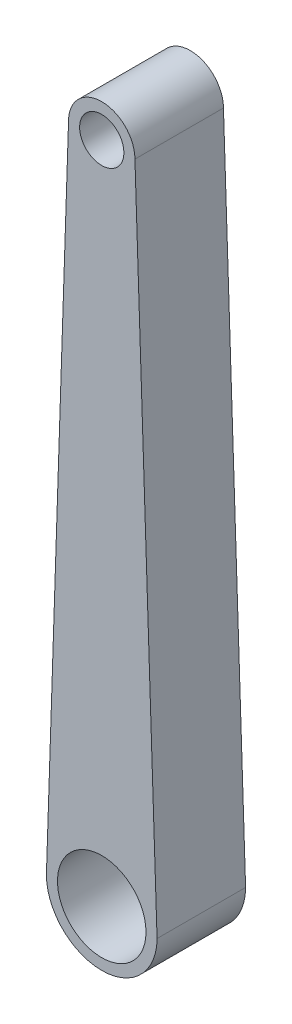
ISO-10303-21;
HEADER;
FILE_DESCRIPTION(('STEP AP214'),'2;1');
FILE_NAME('part.step','',(''),(''),'','','');
FILE_SCHEMA(('AUTOMOTIVE_DESIGN { 1 0 10303 214 1 1 1 1 }'));
ENDSEC;
DATA;
#1=APPLICATION_CONTEXT('core data for automotive mechanical design processes');
#2=APPLICATION_PROTOCOL_DEFINITION('international standard','automotive_design',2000,#1);
#3=PRODUCT_CONTEXT('',#1,'mechanical');
#4=PRODUCT('Part','Part','',(#3));
#5=PRODUCT_RELATED_PRODUCT_CATEGORY('part','',(#4));
#6=PRODUCT_DEFINITION_FORMATION('','',#4);
#7=PRODUCT_DEFINITION_CONTEXT('part definition',#1,'design');
#8=PRODUCT_DEFINITION('design','',#6,#7);
#9=PRODUCT_DEFINITION_SHAPE('','',#8);
#10=(LENGTH_UNIT() NAMED_UNIT(*) SI_UNIT(.MILLI.,.METRE.));
#11=(NAMED_UNIT(*) PLANE_ANGLE_UNIT() SI_UNIT($,.RADIAN.));
#12=(NAMED_UNIT(*) SI_UNIT($,.STERADIAN.) SOLID_ANGLE_UNIT());
#13=UNCERTAINTY_MEASURE_WITH_UNIT(LENGTH_MEASURE(1.E-05),#10,'distance_accuracy_value','');
#14=(GEOMETRIC_REPRESENTATION_CONTEXT(3) GLOBAL_UNCERTAINTY_ASSIGNED_CONTEXT((#13)) GLOBAL_UNIT_ASSIGNED_CONTEXT((#10,
#11,#12)) REPRESENTATION_CONTEXT('',''));
#15=CARTESIAN_POINT('',(0.,0.,0.));
#16=DIRECTION('',(0.,0.,1.));
#17=DIRECTION('',(1.,0.,0.));
#18=AXIS2_PLACEMENT_3D('',#15,#16,#17);
#19=CARTESIAN_POINT('',(-23.1485297273929,0.771617657579759,40.));
#20=DIRECTION('',(0.999444906979154,-0.0333148302326384,0.));
#21=DIRECTION('',(0.0333148302326384,0.999444906979154,0.));
#22=AXIS2_PLACEMENT_3D('',#19,#20,#21);
#23=PLANE('',#22);
#24=DIRECTION('',(-0.0333148302326384,-0.999444906979154,0.));
#25=VECTOR('',#24,1.);
#26=CARTESIAN_POINT('',(-23.1485297273929,0.771617657579759,0.));
#27=LINE('',#26,#25);
#28=CARTESIAN_POINT('',(-15.,245.227509479367,0.));
#29=VERTEX_POINT('',#28);
#30=CARTESIAN_POINT('',(-25.,-54.7724905206331,0.));
#31=VERTEX_POINT('',#30);
#32=EDGE_CURVE('E105',#29,#31,#27,.T.);
#33=ORIENTED_EDGE('',*,*,#32,.T.);
#34=DIRECTION('',(0.,0.,-1.));
#35=VECTOR('',#34,1.);
#36=CARTESIAN_POINT('',(-25.,-54.7724905206331,40.));
#37=LINE('',#36,#35);
#38=CARTESIAN_POINT('',(-25.,-54.7724905206331,40.));
#39=VERTEX_POINT('',#38);
#40=EDGE_CURVE('E11',#39,#31,#37,.T.);
#41=ORIENTED_EDGE('',*,*,#40,.F.);
#42=DIRECTION('',(-0.0333148302326384,-0.999444906979154,0.));
#43=VECTOR('',#42,1.);
#44=CARTESIAN_POINT('',(-23.1485297273929,0.771617657579759,40.));
#45=LINE('',#44,#43);
#46=CARTESIAN_POINT('',(-15.,245.227509479367,40.));
#47=VERTEX_POINT('',#46);
#48=EDGE_CURVE('E84',#47,#39,#45,.T.);
#49=ORIENTED_EDGE('',*,*,#48,.F.);
#50=DIRECTION('',(0.,0.,-1.));
#51=VECTOR('',#50,1.);
#52=CARTESIAN_POINT('',(-15.,245.227509479367,40.));
#53=LINE('',#52,#51);
#54=EDGE_CURVE('E95',#47,#29,#53,.T.);
#55=ORIENTED_EDGE('',*,*,#54,.T.);
#56=EDGE_LOOP('',(#33,#41,#49,#55));
#57=FACE_BOUND('',#56,.T.);
#58=ADVANCED_FACE('F36',(#57),#23,.F.);
#59=CARTESIAN_POINT('',(0.,-54.7724905206331,40.));
#60=DIRECTION('',(0.,0.,-1.));
#61=DIRECTION('',(-1.,0.,0.));
#62=AXIS2_PLACEMENT_3D('',#59,#60,#61);
#63=CYLINDRICAL_SURFACE('',#62,25.);
#64=CARTESIAN_POINT('',(0.,-54.7724905206331,0.));
#65=DIRECTION('',(0.,0.,1.));
#66=DIRECTION('',(1.,0.,0.));
#67=AXIS2_PLACEMENT_3D('',#64,#65,#66);
#68=CIRCLE('',#67,25.);
#69=CARTESIAN_POINT('',(25.,-54.7724905206331,0.));
#70=VERTEX_POINT('',#69);
#71=EDGE_CURVE('E89',#31,#70,#68,.T.);
#72=ORIENTED_EDGE('',*,*,#71,.T.);
#73=DIRECTION('',(0.,0.,-1.));
#74=VECTOR('',#73,1.);
#75=CARTESIAN_POINT('',(25.,-54.7724905206331,40.));
#76=LINE('',#75,#74);
#77=CARTESIAN_POINT('',(25.,-54.7724905206331,40.));
#78=VERTEX_POINT('',#77);
#79=EDGE_CURVE('E45',#78,#70,#76,.T.);
#80=ORIENTED_EDGE('',*,*,#79,.F.);
#81=CARTESIAN_POINT('',(0.,-54.7724905206331,40.));
#82=DIRECTION('',(0.,0.,1.));
#83=DIRECTION('',(1.,0.,0.));
#84=AXIS2_PLACEMENT_3D('',#81,#82,#83);
#85=CIRCLE('',#84,25.);
#86=EDGE_CURVE('E79',#39,#78,#85,.T.);
#87=ORIENTED_EDGE('',*,*,#86,.F.);
#88=ORIENTED_EDGE('',*,*,#40,.T.);
#89=EDGE_LOOP('',(#72,#80,#87,#88));
#90=FACE_BOUND('',#89,.T.);
#91=ADVANCED_FACE('F88',(#90),#63,.T.);
#92=CARTESIAN_POINT('',(23.1485297273929,0.771617657579759,40.));
#93=DIRECTION('',(0.999444906979154,0.0333148302326384,0.));
#94=DIRECTION('',(-0.0333148302326384,0.999444906979154,0.));
#95=AXIS2_PLACEMENT_3D('',#92,#93,#94);
#96=PLANE('',#95);
#97=DIRECTION('',(0.0333148302326384,-0.999444906979154,0.));
#98=VECTOR('',#97,1.);
#99=CARTESIAN_POINT('',(23.1485297273929,0.771617657579759,0.));
#100=LINE('',#99,#98);
#101=CARTESIAN_POINT('',(15.,245.227509479367,0.));
#102=VERTEX_POINT('',#101);
#103=EDGE_CURVE('E109',#102,#70,#100,.T.);
#104=ORIENTED_EDGE('',*,*,#103,.F.);
#105=DIRECTION('',(0.,0.,-1.));
#106=VECTOR('',#105,1.);
#107=CARTESIAN_POINT('',(15.,245.227509479367,40.));
#108=LINE('',#107,#106);
#109=CARTESIAN_POINT('',(15.,245.227509479367,40.));
#110=VERTEX_POINT('',#109);
#111=EDGE_CURVE('E69',#110,#102,#108,.T.);
#112=ORIENTED_EDGE('',*,*,#111,.F.);
#113=DIRECTION('',(0.0333148302326384,-0.999444906979154,0.));
#114=VECTOR('',#113,1.);
#115=CARTESIAN_POINT('',(23.1485297273929,0.771617657579759,40.));
#116=LINE('',#115,#114);
#117=EDGE_CURVE('E82',#110,#78,#116,.T.);
#118=ORIENTED_EDGE('',*,*,#117,.T.);
#119=ORIENTED_EDGE('',*,*,#79,.T.);
#120=EDGE_LOOP('',(#104,#112,#118,#119));
#121=FACE_BOUND('',#120,.T.);
#122=ADVANCED_FACE('F93',(#121),#96,.T.);
#123=CARTESIAN_POINT('',(0.,245.227509479367,40.));
#124=DIRECTION('',(0.,0.,-1.));
#125=DIRECTION('',(-1.,0.,0.));
#126=AXIS2_PLACEMENT_3D('',#123,#124,#125);
#127=CYLINDRICAL_SURFACE('',#126,10.);
#128=CARTESIAN_POINT('',(0.,245.227509479367,40.));
#129=DIRECTION('',(0.,0.,1.));
#130=DIRECTION('',(1.,0.,0.));
#131=AXIS2_PLACEMENT_3D('',#128,#129,#130);
#132=CIRCLE('',#131,10.);
#133=CARTESIAN_POINT('',(10.,245.227509479367,40.));
#134=VERTEX_POINT('',#133);
#135=EDGE_CURVE('E147',#134,#134,#132,.T.);
#136=ORIENTED_EDGE('',*,*,#135,.T.);
#137=EDGE_LOOP('',(#136));
#138=FACE_BOUND('',#137,.T.);
#139=CARTESIAN_POINT('',(0.,245.227509479367,0.));
#140=DIRECTION('',(0.,0.,1.));
#141=DIRECTION('',(1.,0.,0.));
#142=AXIS2_PLACEMENT_3D('',#139,#140,#141);
#143=CIRCLE('',#142,10.);
#144=CARTESIAN_POINT('',(10.,245.227509479367,0.));
#145=VERTEX_POINT('',#144);
#146=EDGE_CURVE('E102',#145,#145,#143,.T.);
#147=ORIENTED_EDGE('',*,*,#146,.F.);
#148=EDGE_LOOP('',(#147));
#149=FACE_BOUND('',#148,.T.);
#150=ADVANCED_FACE('F136',(#138,#149),#127,.F.);
#151=CARTESIAN_POINT('',(0.,-54.7724905206331,40.));
#152=DIRECTION('',(0.,0.,-1.));
#153=DIRECTION('',(-1.,0.,0.));
#154=AXIS2_PLACEMENT_3D('',#151,#152,#153);
#155=CYLINDRICAL_SURFACE('',#154,20.);
#156=CARTESIAN_POINT('',(0.,-54.7724905206331,40.));
#157=DIRECTION('',(0.,0.,1.));
#158=DIRECTION('',(1.,0.,0.));
#159=AXIS2_PLACEMENT_3D('',#156,#157,#158);
#160=CIRCLE('',#159,20.);
#161=CARTESIAN_POINT('',(20.,-54.7724905206331,40.));
#162=VERTEX_POINT('',#161);
#163=EDGE_CURVE('E112',#162,#162,#160,.T.);
#164=ORIENTED_EDGE('',*,*,#163,.T.);
#165=EDGE_LOOP('',(#164));
#166=FACE_BOUND('',#165,.T.);
#167=CARTESIAN_POINT('',(0.,-54.7724905206331,0.));
#168=DIRECTION('',(0.,0.,1.));
#169=DIRECTION('',(1.,0.,0.));
#170=AXIS2_PLACEMENT_3D('',#167,#168,#169);
#171=CIRCLE('',#170,20.);
#172=CARTESIAN_POINT('',(20.,-54.7724905206331,0.));
#173=VERTEX_POINT('',#172);
#174=EDGE_CURVE('E99',#173,#173,#171,.T.);
#175=ORIENTED_EDGE('',*,*,#174,.F.);
#176=EDGE_LOOP('',(#175));
#177=FACE_BOUND('',#176,.T.);
#178=ADVANCED_FACE('F38',(#166,#177),#155,.F.);
#179=CARTESIAN_POINT('',(0.,245.227509479367,40.));
#180=DIRECTION('',(0.,0.,-1.));
#181=DIRECTION('',(-1.,0.,0.));
#182=AXIS2_PLACEMENT_3D('',#179,#180,#181);
#183=CYLINDRICAL_SURFACE('',#182,15.);
#184=CARTESIAN_POINT('',(0.,245.227509479367,0.));
#185=DIRECTION('',(0.,0.,1.));
#186=DIRECTION('',(1.,0.,0.));
#187=AXIS2_PLACEMENT_3D('',#184,#185,#186);
#188=CIRCLE('',#187,15.);
#189=EDGE_CURVE('E72',#102,#29,#188,.T.);
#190=ORIENTED_EDGE('',*,*,#189,.T.);
#191=ORIENTED_EDGE('',*,*,#54,.F.);
#192=CARTESIAN_POINT('',(0.,245.227509479367,40.));
#193=DIRECTION('',(0.,0.,1.));
#194=DIRECTION('',(1.,0.,0.));
#195=AXIS2_PLACEMENT_3D('',#192,#193,#194);
#196=CIRCLE('',#195,15.);
#197=EDGE_CURVE('E53',#110,#47,#196,.T.);
#198=ORIENTED_EDGE('',*,*,#197,.F.);
#199=ORIENTED_EDGE('',*,*,#111,.T.);
#200=EDGE_LOOP('',(#190,#191,#198,#199));
#201=FACE_BOUND('',#200,.T.);
#202=ADVANCED_FACE('F124',(#201),#183,.T.);
#203=CARTESIAN_POINT('',(0.,0.,40.));
#204=DIRECTION('',(0.,0.,1.));
#205=DIRECTION('',(1.,0.,0.));
#206=AXIS2_PLACEMENT_3D('',#203,#204,#205);
#207=PLANE('',#206);
#208=ORIENTED_EDGE('',*,*,#163,.F.);
#209=EDGE_LOOP('',(#208));
#210=FACE_BOUND('',#209,.T.);
#211=ORIENTED_EDGE('',*,*,#135,.F.);
#212=EDGE_LOOP('',(#211));
#213=FACE_BOUND('',#212,.T.);
#214=ORIENTED_EDGE('',*,*,#48,.T.);
#215=ORIENTED_EDGE('',*,*,#86,.T.);
#216=ORIENTED_EDGE('',*,*,#117,.F.);
#217=ORIENTED_EDGE('',*,*,#197,.T.);
#218=EDGE_LOOP('',(#214,#215,#216,#217));
#219=FACE_BOUND('',#218,.T.);
#220=ADVANCED_FACE('F80',(#210,#213,#219),#207,.T.);
#221=CARTESIAN_POINT('',(0.,0.,0.));
#222=DIRECTION('',(0.,0.,1.));
#223=DIRECTION('',(1.,0.,0.));
#224=AXIS2_PLACEMENT_3D('',#221,#222,#223);
#225=PLANE('',#224);
#226=ORIENTED_EDGE('',*,*,#174,.T.);
#227=EDGE_LOOP('',(#226));
#228=FACE_BOUND('',#227,.T.);
#229=ORIENTED_EDGE('',*,*,#146,.T.);
#230=EDGE_LOOP('',(#229));
#231=FACE_BOUND('',#230,.T.);
#232=ORIENTED_EDGE('',*,*,#32,.F.);
#233=ORIENTED_EDGE('',*,*,#189,.F.);
#234=ORIENTED_EDGE('',*,*,#103,.T.);
#235=ORIENTED_EDGE('',*,*,#71,.F.);
#236=EDGE_LOOP('',(#232,#233,#234,#235));
#237=FACE_BOUND('',#236,.T.);
#238=ADVANCED_FACE('F117',(#228,#231,#237),#225,.F.);
#239=CLOSED_SHELL('',(#58,#91,#122,#150,#178,#202,#220,#238));
#240=MANIFOLD_SOLID_BREP('B2',#239);
#241=ADVANCED_BREP_SHAPE_REPRESENTATION('',(#18,#240),#14);
#242=SHAPE_DEFINITION_REPRESENTATION(#9,#241);
ENDSEC;
END-ISO-10303-21;
